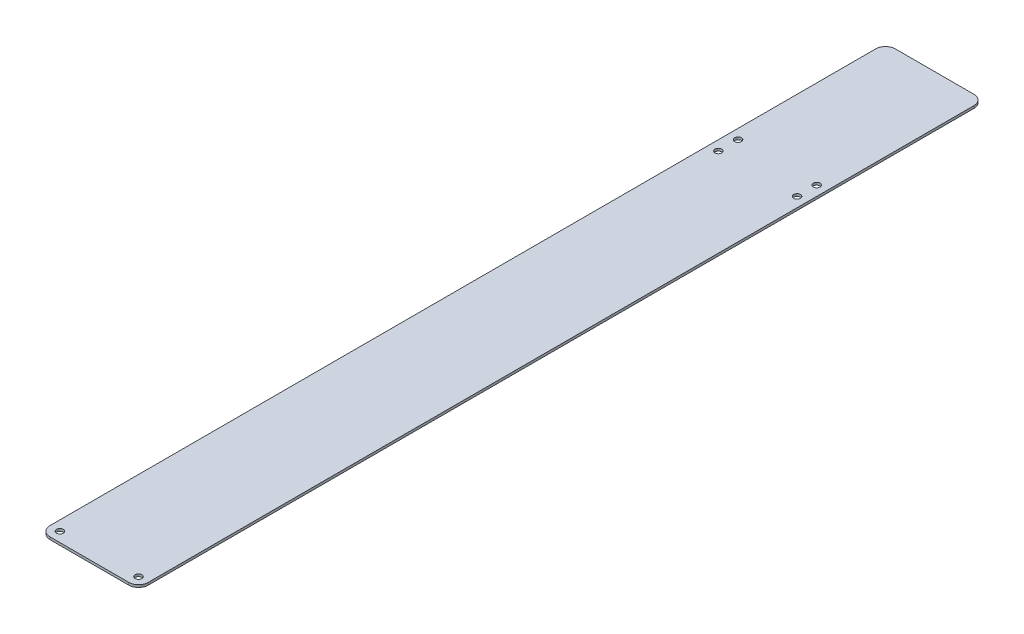
ISO-10303-21;
HEADER;
FILE_DESCRIPTION(('STEP AP214'),'2;1');
FILE_NAME('part.step','',(''),(''),'','','');
FILE_SCHEMA(('AUTOMOTIVE_DESIGN { 1 0 10303 214 1 1 1 1 }'));
ENDSEC;
DATA;
#1=APPLICATION_CONTEXT('core data for automotive mechanical design processes');
#2=APPLICATION_PROTOCOL_DEFINITION('international standard','automotive_design',2000,#1);
#3=PRODUCT_CONTEXT('',#1,'mechanical');
#4=PRODUCT('Part','Part','',(#3));
#5=PRODUCT_RELATED_PRODUCT_CATEGORY('part','',(#4));
#6=PRODUCT_DEFINITION_FORMATION('','',#4);
#7=PRODUCT_DEFINITION_CONTEXT('part definition',#1,'design');
#8=PRODUCT_DEFINITION('design','',#6,#7);
#9=PRODUCT_DEFINITION_SHAPE('','',#8);
#10=(LENGTH_UNIT() NAMED_UNIT(*) SI_UNIT(.MILLI.,.METRE.));
#11=(NAMED_UNIT(*) PLANE_ANGLE_UNIT() SI_UNIT($,.RADIAN.));
#12=(NAMED_UNIT(*) SI_UNIT($,.STERADIAN.) SOLID_ANGLE_UNIT());
#13=UNCERTAINTY_MEASURE_WITH_UNIT(LENGTH_MEASURE(1.E-05),#10,'distance_accuracy_value','');
#14=(GEOMETRIC_REPRESENTATION_CONTEXT(3) GLOBAL_UNCERTAINTY_ASSIGNED_CONTEXT((#13)) GLOBAL_UNIT_ASSIGNED_CONTEXT((#10,
#11,#12)) REPRESENTATION_CONTEXT('',''));
#15=CARTESIAN_POINT('',(0.,0.,0.));
#16=DIRECTION('',(0.,0.,1.));
#17=DIRECTION('',(1.,0.,0.));
#18=AXIS2_PLACEMENT_3D('',#15,#16,#17);
#19=CARTESIAN_POINT('',(6.35,0.79375,-539.75));
#20=DIRECTION('',(0.,1.,0.));
#21=DIRECTION('',(0.,0.,1.));
#22=AXIS2_PLACEMENT_3D('',#19,#20,#21);
#23=PLANE('',#22);
#24=CARTESIAN_POINT('',(57.15,0.79375,-431.8));
#25=DIRECTION('',(0.,1.,0.));
#26=DIRECTION('',(0.,0.,1.));
#27=AXIS2_PLACEMENT_3D('',#24,#25,#26);
#28=CIRCLE('',#27,2.1828125);
#29=CARTESIAN_POINT('',(57.15,0.79375,-429.6171875));
#30=VERTEX_POINT('',#29);
#31=EDGE_CURVE('E239',#30,#30,#28,.T.);
#32=ORIENTED_EDGE('',*,*,#31,.F.);
#33=EDGE_LOOP('',(#32));
#34=FACE_BOUND('',#33,.T.);
#35=CARTESIAN_POINT('',(6.35,0.79375,-6.35));
#36=DIRECTION('',(0.,1.,0.));
#37=DIRECTION('',(0.,0.,1.));
#38=AXIS2_PLACEMENT_3D('',#35,#36,#37);
#39=CIRCLE('',#38,2.1828125);
#40=CARTESIAN_POINT('',(6.35,0.79375,-4.1671875));
#41=VERTEX_POINT('',#40);
#42=EDGE_CURVE('E223',#41,#41,#39,.T.);
#43=ORIENTED_EDGE('',*,*,#42,.F.);
#44=EDGE_LOOP('',(#43));
#45=FACE_BOUND('',#44,.T.);
#46=CARTESIAN_POINT('',(6.35,0.79375,-431.8));
#47=DIRECTION('',(0.,1.,0.));
#48=DIRECTION('',(0.,0.,1.));
#49=AXIS2_PLACEMENT_3D('',#46,#47,#48);
#50=CIRCLE('',#49,2.1828125);
#51=CARTESIAN_POINT('',(6.35,0.79375,-429.6171875));
#52=VERTEX_POINT('',#51);
#53=EDGE_CURVE('E148',#52,#52,#50,.T.);
#54=ORIENTED_EDGE('',*,*,#53,.F.);
#55=EDGE_LOOP('',(#54));
#56=FACE_BOUND('',#55,.T.);
#57=CARTESIAN_POINT('',(6.35,0.79375,-539.75));
#58=DIRECTION('',(0.,1.,0.));
#59=DIRECTION('',(0.,0.,1.));
#60=AXIS2_PLACEMENT_3D('',#57,#58,#59);
#61=CIRCLE('',#60,6.34999999999998);
#62=CARTESIAN_POINT('',(6.35,0.79375,-546.1));
#63=VERTEX_POINT('',#62);
#64=CARTESIAN_POINT('',(0.,0.79375,-539.75));
#65=VERTEX_POINT('',#64);
#66=EDGE_CURVE('E166',#63,#65,#61,.T.);
#67=ORIENTED_EDGE('',*,*,#66,.T.);
#68=DIRECTION('',(0.,0.,1.));
#69=VECTOR('',#68,1.);
#70=CARTESIAN_POINT('',(0.,0.79375,-6.35000000000004));
#71=LINE('',#70,#69);
#72=CARTESIAN_POINT('',(0.,0.79375,-6.35000000000004));
#73=VERTEX_POINT('',#72);
#74=EDGE_CURVE('E102',#65,#73,#71,.T.);
#75=ORIENTED_EDGE('',*,*,#74,.T.);
#76=CARTESIAN_POINT('',(6.35,0.79375,-6.35));
#77=DIRECTION('',(0.,1.,0.));
#78=DIRECTION('',(0.,0.,-1.));
#79=AXIS2_PLACEMENT_3D('',#76,#77,#78);
#80=CIRCLE('',#79,6.35);
#81=CARTESIAN_POINT('',(6.35000000000004,0.79375,0.));
#82=VERTEX_POINT('',#81);
#83=EDGE_CURVE('E187',#73,#82,#80,.T.);
#84=ORIENTED_EDGE('',*,*,#83,.T.);
#85=DIRECTION('',(1.,0.,0.));
#86=VECTOR('',#85,1.);
#87=CARTESIAN_POINT('',(6.35000000000004,0.79375,0.));
#88=LINE('',#87,#86);
#89=CARTESIAN_POINT('',(57.15,0.79375,0.));
#90=VERTEX_POINT('',#89);
#91=EDGE_CURVE('E201',#82,#90,#88,.T.);
#92=ORIENTED_EDGE('',*,*,#91,.T.);
#93=CARTESIAN_POINT('',(57.15,0.79375,-6.35));
#94=DIRECTION('',(0.,1.,0.));
#95=DIRECTION('',(0.,0.,-1.));
#96=AXIS2_PLACEMENT_3D('',#93,#94,#95);
#97=CIRCLE('',#96,6.35);
#98=CARTESIAN_POINT('',(63.5,0.79375,-6.35000000000004));
#99=VERTEX_POINT('',#98);
#100=EDGE_CURVE('E121',#90,#99,#97,.T.);
#101=ORIENTED_EDGE('',*,*,#100,.T.);
#102=DIRECTION('',(0.,0.,-1.));
#103=VECTOR('',#102,1.);
#104=CARTESIAN_POINT('',(63.5,0.79375,-6.35000000000004));
#105=LINE('',#104,#103);
#106=CARTESIAN_POINT('',(63.5,0.79375,-539.75));
#107=VERTEX_POINT('',#106);
#108=EDGE_CURVE('E115',#99,#107,#105,.T.);
#109=ORIENTED_EDGE('',*,*,#108,.T.);
#110=CARTESIAN_POINT('',(57.15,0.79375,-539.75));
#111=DIRECTION('',(0.,1.,0.));
#112=DIRECTION('',(0.,0.,1.));
#113=AXIS2_PLACEMENT_3D('',#110,#111,#112);
#114=CIRCLE('',#113,6.34999999999999);
#115=CARTESIAN_POINT('',(57.15,0.79375,-546.1));
#116=VERTEX_POINT('',#115);
#117=EDGE_CURVE('E119',#107,#116,#114,.T.);
#118=ORIENTED_EDGE('',*,*,#117,.T.);
#119=DIRECTION('',(-1.,0.,0.));
#120=VECTOR('',#119,1.);
#121=CARTESIAN_POINT('',(6.35,0.79375,-546.1));
#122=LINE('',#121,#120);
#123=EDGE_CURVE('E59',#116,#63,#122,.T.);
#124=ORIENTED_EDGE('',*,*,#123,.T.);
#125=EDGE_LOOP('',(#67,#75,#84,#92,#101,#109,#118,#124));
#126=FACE_BOUND('',#125,.T.);
#127=CARTESIAN_POINT('',(6.35,0.79375,-444.5));
#128=DIRECTION('',(0.,1.,0.));
#129=DIRECTION('',(0.,0.,1.));
#130=AXIS2_PLACEMENT_3D('',#127,#128,#129);
#131=CIRCLE('',#130,2.1828125);
#132=CARTESIAN_POINT('',(6.35,0.79375,-442.3171875));
#133=VERTEX_POINT('',#132);
#134=EDGE_CURVE('E215',#133,#133,#131,.T.);
#135=ORIENTED_EDGE('',*,*,#134,.F.);
#136=EDGE_LOOP('',(#135));
#137=FACE_BOUND('',#136,.T.);
#138=CARTESIAN_POINT('',(57.15,0.79375,-6.35));
#139=DIRECTION('',(0.,1.,0.));
#140=DIRECTION('',(0.,0.,1.));
#141=AXIS2_PLACEMENT_3D('',#138,#139,#140);
#142=CIRCLE('',#141,2.1828125);
#143=CARTESIAN_POINT('',(57.15,0.79375,-4.1671875));
#144=VERTEX_POINT('',#143);
#145=EDGE_CURVE('E231',#144,#144,#142,.T.);
#146=ORIENTED_EDGE('',*,*,#145,.F.);
#147=EDGE_LOOP('',(#146));
#148=FACE_BOUND('',#147,.T.);
#149=CARTESIAN_POINT('',(57.15,0.79375,-444.5));
#150=DIRECTION('',(0.,1.,0.));
#151=DIRECTION('',(0.,0.,1.));
#152=AXIS2_PLACEMENT_3D('',#149,#150,#151);
#153=CIRCLE('',#152,2.1828125);
#154=CARTESIAN_POINT('',(57.15,0.79375,-442.3171875));
#155=VERTEX_POINT('',#154);
#156=EDGE_CURVE('E247',#155,#155,#153,.T.);
#157=ORIENTED_EDGE('',*,*,#156,.F.);
#158=EDGE_LOOP('',(#157));
#159=FACE_BOUND('',#158,.T.);
#160=ADVANCED_FACE('F41',(#34,#45,#56,#126,#137,#148,#159),#23,.T.);
#161=CARTESIAN_POINT('',(6.35,-0.79375,-539.75));
#162=DIRECTION('',(0.,1.,0.));
#163=DIRECTION('',(0.,0.,1.));
#164=AXIS2_PLACEMENT_3D('',#161,#162,#163);
#165=PLANE('',#164);
#166=CARTESIAN_POINT('',(6.35,-0.79375,-539.75));
#167=DIRECTION('',(0.,1.,0.));
#168=DIRECTION('',(0.,0.,1.));
#169=AXIS2_PLACEMENT_3D('',#166,#167,#168);
#170=CIRCLE('',#169,6.34999999999998);
#171=CARTESIAN_POINT('',(6.35,-0.79375,-546.1));
#172=VERTEX_POINT('',#171);
#173=CARTESIAN_POINT('',(0.,-0.79375,-539.75));
#174=VERTEX_POINT('',#173);
#175=EDGE_CURVE('E143',#172,#174,#170,.T.);
#176=ORIENTED_EDGE('',*,*,#175,.F.);
#177=DIRECTION('',(-1.,0.,0.));
#178=VECTOR('',#177,1.);
#179=CARTESIAN_POINT('',(6.35,-0.79375,-546.1));
#180=LINE('',#179,#178);
#181=CARTESIAN_POINT('',(57.15,-0.79375,-546.1));
#182=VERTEX_POINT('',#181);
#183=EDGE_CURVE('E94',#182,#172,#180,.T.);
#184=ORIENTED_EDGE('',*,*,#183,.F.);
#185=CARTESIAN_POINT('',(57.15,-0.79375,-539.75));
#186=DIRECTION('',(0.,1.,0.));
#187=DIRECTION('',(0.,0.,1.));
#188=AXIS2_PLACEMENT_3D('',#185,#186,#187);
#189=CIRCLE('',#188,6.34999999999999);
#190=CARTESIAN_POINT('',(63.5,-0.79375,-539.75));
#191=VERTEX_POINT('',#190);
#192=EDGE_CURVE('E88',#191,#182,#189,.T.);
#193=ORIENTED_EDGE('',*,*,#192,.F.);
#194=DIRECTION('',(0.,0.,-1.));
#195=VECTOR('',#194,1.);
#196=CARTESIAN_POINT('',(63.5,-0.79375,-6.35000000000004));
#197=LINE('',#196,#195);
#198=CARTESIAN_POINT('',(63.5,-0.79375,-6.35000000000004));
#199=VERTEX_POINT('',#198);
#200=EDGE_CURVE('E130',#199,#191,#197,.T.);
#201=ORIENTED_EDGE('',*,*,#200,.F.);
#202=CARTESIAN_POINT('',(57.15,-0.79375,-6.35));
#203=DIRECTION('',(0.,1.,0.));
#204=DIRECTION('',(0.,0.,-1.));
#205=AXIS2_PLACEMENT_3D('',#202,#203,#204);
#206=CIRCLE('',#205,6.35);
#207=CARTESIAN_POINT('',(57.15,-0.79375,0.));
#208=VERTEX_POINT('',#207);
#209=EDGE_CURVE('E157',#208,#199,#206,.T.);
#210=ORIENTED_EDGE('',*,*,#209,.F.);
#211=DIRECTION('',(1.,0.,0.));
#212=VECTOR('',#211,1.);
#213=CARTESIAN_POINT('',(6.35000000000004,-0.79375,0.));
#214=LINE('',#213,#212);
#215=CARTESIAN_POINT('',(6.35000000000004,-0.79375,0.));
#216=VERTEX_POINT('',#215);
#217=EDGE_CURVE('E154',#216,#208,#214,.T.);
#218=ORIENTED_EDGE('',*,*,#217,.F.);
#219=CARTESIAN_POINT('',(6.35,-0.79375,-6.35));
#220=DIRECTION('',(0.,1.,0.));
#221=DIRECTION('',(0.,0.,-1.));
#222=AXIS2_PLACEMENT_3D('',#219,#220,#221);
#223=CIRCLE('',#222,6.35);
#224=CARTESIAN_POINT('',(0.,-0.79375,-6.35000000000004));
#225=VERTEX_POINT('',#224);
#226=EDGE_CURVE('E151',#225,#216,#223,.T.);
#227=ORIENTED_EDGE('',*,*,#226,.F.);
#228=DIRECTION('',(0.,0.,1.));
#229=VECTOR('',#228,1.);
#230=CARTESIAN_POINT('',(0.,-0.79375,-6.35000000000004));
#231=LINE('',#230,#229);
#232=EDGE_CURVE('E147',#174,#225,#231,.T.);
#233=ORIENTED_EDGE('',*,*,#232,.F.);
#234=EDGE_LOOP('',(#176,#184,#193,#201,#210,#218,#227,#233));
#235=FACE_BOUND('',#234,.T.);
#236=CARTESIAN_POINT('',(6.35,-0.79375,-431.8));
#237=DIRECTION('',(0.,1.,0.));
#238=DIRECTION('',(0.,0.,1.));
#239=AXIS2_PLACEMENT_3D('',#236,#237,#238);
#240=CIRCLE('',#239,2.1828125);
#241=CARTESIAN_POINT('',(6.35,-0.79375,-429.6171875));
#242=VERTEX_POINT('',#241);
#243=EDGE_CURVE('E211',#242,#242,#240,.T.);
#244=ORIENTED_EDGE('',*,*,#243,.T.);
#245=EDGE_LOOP('',(#244));
#246=FACE_BOUND('',#245,.T.);
#247=CARTESIAN_POINT('',(6.35,-0.79375,-444.5));
#248=DIRECTION('',(0.,1.,0.));
#249=DIRECTION('',(0.,0.,1.));
#250=AXIS2_PLACEMENT_3D('',#247,#248,#249);
#251=CIRCLE('',#250,2.1828125);
#252=CARTESIAN_POINT('',(6.35,-0.79375,-442.3171875));
#253=VERTEX_POINT('',#252);
#254=EDGE_CURVE('E219',#253,#253,#251,.T.);
#255=ORIENTED_EDGE('',*,*,#254,.T.);
#256=EDGE_LOOP('',(#255));
#257=FACE_BOUND('',#256,.T.);
#258=CARTESIAN_POINT('',(6.35,-0.79375,-6.35));
#259=DIRECTION('',(0.,1.,0.));
#260=DIRECTION('',(0.,0.,1.));
#261=AXIS2_PLACEMENT_3D('',#258,#259,#260);
#262=CIRCLE('',#261,2.1828125);
#263=CARTESIAN_POINT('',(6.35,-0.79375,-4.1671875));
#264=VERTEX_POINT('',#263);
#265=EDGE_CURVE('E227',#264,#264,#262,.T.);
#266=ORIENTED_EDGE('',*,*,#265,.T.);
#267=EDGE_LOOP('',(#266));
#268=FACE_BOUND('',#267,.T.);
#269=CARTESIAN_POINT('',(57.15,-0.79375,-6.35));
#270=DIRECTION('',(0.,1.,0.));
#271=DIRECTION('',(0.,0.,1.));
#272=AXIS2_PLACEMENT_3D('',#269,#270,#271);
#273=CIRCLE('',#272,2.1828125);
#274=CARTESIAN_POINT('',(57.15,-0.79375,-4.1671875));
#275=VERTEX_POINT('',#274);
#276=EDGE_CURVE('E235',#275,#275,#273,.T.);
#277=ORIENTED_EDGE('',*,*,#276,.T.);
#278=EDGE_LOOP('',(#277));
#279=FACE_BOUND('',#278,.T.);
#280=CARTESIAN_POINT('',(57.15,-0.79375,-431.8));
#281=DIRECTION('',(0.,1.,0.));
#282=DIRECTION('',(0.,0.,1.));
#283=AXIS2_PLACEMENT_3D('',#280,#281,#282);
#284=CIRCLE('',#283,2.1828125);
#285=CARTESIAN_POINT('',(57.15,-0.79375,-429.6171875));
#286=VERTEX_POINT('',#285);
#287=EDGE_CURVE('E243',#286,#286,#284,.T.);
#288=ORIENTED_EDGE('',*,*,#287,.T.);
#289=EDGE_LOOP('',(#288));
#290=FACE_BOUND('',#289,.T.);
#291=CARTESIAN_POINT('',(57.15,-0.79375,-444.5));
#292=DIRECTION('',(0.,1.,0.));
#293=DIRECTION('',(0.,0.,1.));
#294=AXIS2_PLACEMENT_3D('',#291,#292,#293);
#295=CIRCLE('',#294,2.1828125);
#296=CARTESIAN_POINT('',(57.15,-0.79375,-442.3171875));
#297=VERTEX_POINT('',#296);
#298=EDGE_CURVE('E251',#297,#297,#295,.T.);
#299=ORIENTED_EDGE('',*,*,#298,.T.);
#300=EDGE_LOOP('',(#299));
#301=FACE_BOUND('',#300,.T.);
#302=ADVANCED_FACE('F191',(#235,#246,#257,#268,#279,#290,#301),#165,.F.);
#303=CARTESIAN_POINT('',(6.35,0.79375,-539.75));
#304=DIRECTION('',(0.,-1.,0.));
#305=DIRECTION('',(0.,0.,-1.));
#306=AXIS2_PLACEMENT_3D('',#303,#304,#305);
#307=CYLINDRICAL_SURFACE('',#306,6.34999999999998);
#308=ORIENTED_EDGE('',*,*,#175,.T.);
#309=DIRECTION('',(0.,-1.,0.));
#310=VECTOR('',#309,1.);
#311=CARTESIAN_POINT('',(0.,0.79375,-539.75));
#312=LINE('',#311,#310);
#313=EDGE_CURVE('E11',#65,#174,#312,.T.);
#314=ORIENTED_EDGE('',*,*,#313,.F.);
#315=ORIENTED_EDGE('',*,*,#66,.F.);
#316=DIRECTION('',(0.,-1.,0.));
#317=VECTOR('',#316,1.);
#318=CARTESIAN_POINT('',(6.35,0.79375,-546.1));
#319=LINE('',#318,#317);
#320=EDGE_CURVE('E139',#63,#172,#319,.T.);
#321=ORIENTED_EDGE('',*,*,#320,.T.);
#322=EDGE_LOOP('',(#308,#314,#315,#321));
#323=FACE_BOUND('',#322,.T.);
#324=ADVANCED_FACE('F43',(#323),#307,.T.);
#325=CARTESIAN_POINT('',(0.,0.79375,-6.35000000000004));
#326=DIRECTION('',(1.,0.,0.));
#327=DIRECTION('',(0.,0.,-1.));
#328=AXIS2_PLACEMENT_3D('',#325,#326,#327);
#329=PLANE('',#328);
#330=ORIENTED_EDGE('',*,*,#232,.T.);
#331=DIRECTION('',(0.,-1.,0.));
#332=VECTOR('',#331,1.);
#333=CARTESIAN_POINT('',(0.,0.79375,-6.35000000000004));
#334=LINE('',#333,#332);
#335=EDGE_CURVE('E51',#73,#225,#334,.T.);
#336=ORIENTED_EDGE('',*,*,#335,.F.);
#337=ORIENTED_EDGE('',*,*,#74,.F.);
#338=ORIENTED_EDGE('',*,*,#313,.T.);
#339=EDGE_LOOP('',(#330,#336,#337,#338));
#340=FACE_BOUND('',#339,.T.);
#341=ADVANCED_FACE('F287',(#340),#329,.F.);
#342=CARTESIAN_POINT('',(6.35,0.79375,-6.35));
#343=DIRECTION('',(0.,-1.,0.));
#344=DIRECTION('',(0.,0.,-1.));
#345=AXIS2_PLACEMENT_3D('',#342,#343,#344);
#346=CYLINDRICAL_SURFACE('',#345,6.35);
#347=ORIENTED_EDGE('',*,*,#226,.T.);
#348=DIRECTION('',(0.,-1.,0.));
#349=VECTOR('',#348,1.);
#350=CARTESIAN_POINT('',(6.35000000000004,0.79375,0.));
#351=LINE('',#350,#349);
#352=EDGE_CURVE('E177',#82,#216,#351,.T.);
#353=ORIENTED_EDGE('',*,*,#352,.F.);
#354=ORIENTED_EDGE('',*,*,#83,.F.);
#355=ORIENTED_EDGE('',*,*,#335,.T.);
#356=EDGE_LOOP('',(#347,#353,#354,#355));
#357=FACE_BOUND('',#356,.T.);
#358=ADVANCED_FACE('F185',(#357),#346,.T.);
#359=CARTESIAN_POINT('',(6.35000000000004,0.79375,0.));
#360=DIRECTION('',(0.,0.,-1.));
#361=DIRECTION('',(-1.,0.,0.));
#362=AXIS2_PLACEMENT_3D('',#359,#360,#361);
#363=PLANE('',#362);
#364=ORIENTED_EDGE('',*,*,#217,.T.);
#365=DIRECTION('',(0.,-1.,0.));
#366=VECTOR('',#365,1.);
#367=CARTESIAN_POINT('',(57.15,0.79375,0.));
#368=LINE('',#367,#366);
#369=EDGE_CURVE('E173',#90,#208,#368,.T.);
#370=ORIENTED_EDGE('',*,*,#369,.F.);
#371=ORIENTED_EDGE('',*,*,#91,.F.);
#372=ORIENTED_EDGE('',*,*,#352,.T.);
#373=EDGE_LOOP('',(#364,#370,#371,#372));
#374=FACE_BOUND('',#373,.T.);
#375=ADVANCED_FACE('F196',(#374),#363,.F.);
#376=CARTESIAN_POINT('',(57.15,0.79375,-6.35));
#377=DIRECTION('',(0.,-1.,0.));
#378=DIRECTION('',(0.,0.,-1.));
#379=AXIS2_PLACEMENT_3D('',#376,#377,#378);
#380=CYLINDRICAL_SURFACE('',#379,6.35);
#381=ORIENTED_EDGE('',*,*,#209,.T.);
#382=DIRECTION('',(0.,-1.,0.));
#383=VECTOR('',#382,1.);
#384=CARTESIAN_POINT('',(63.5,0.79375,-6.35000000000004));
#385=LINE('',#384,#383);
#386=EDGE_CURVE('E132',#99,#199,#385,.T.);
#387=ORIENTED_EDGE('',*,*,#386,.F.);
#388=ORIENTED_EDGE('',*,*,#100,.F.);
#389=ORIENTED_EDGE('',*,*,#369,.T.);
#390=EDGE_LOOP('',(#381,#387,#388,#389));
#391=FACE_BOUND('',#390,.T.);
#392=ADVANCED_FACE('F199',(#391),#380,.T.);
#393=CARTESIAN_POINT('',(63.5,0.79375,-6.35000000000004));
#394=DIRECTION('',(-1.,0.,0.));
#395=DIRECTION('',(0.,0.,1.));
#396=AXIS2_PLACEMENT_3D('',#393,#394,#395);
#397=PLANE('',#396);
#398=ORIENTED_EDGE('',*,*,#200,.T.);
#399=DIRECTION('',(0.,-1.,0.));
#400=VECTOR('',#399,1.);
#401=CARTESIAN_POINT('',(63.5,0.79375,-539.75));
#402=LINE('',#401,#400);
#403=EDGE_CURVE('E127',#107,#191,#402,.T.);
#404=ORIENTED_EDGE('',*,*,#403,.F.);
#405=ORIENTED_EDGE('',*,*,#108,.F.);
#406=ORIENTED_EDGE('',*,*,#386,.T.);
#407=EDGE_LOOP('',(#398,#404,#405,#406));
#408=FACE_BOUND('',#407,.T.);
#409=ADVANCED_FACE('F128',(#408),#397,.F.);
#410=CARTESIAN_POINT('',(57.15,0.79375,-539.75));
#411=DIRECTION('',(0.,-1.,0.));
#412=DIRECTION('',(0.,0.,-1.));
#413=AXIS2_PLACEMENT_3D('',#410,#411,#412);
#414=CYLINDRICAL_SURFACE('',#413,6.34999999999999);
#415=ORIENTED_EDGE('',*,*,#192,.T.);
#416=DIRECTION('',(0.,-1.,0.));
#417=VECTOR('',#416,1.);
#418=CARTESIAN_POINT('',(57.15,0.79375,-546.1));
#419=LINE('',#418,#417);
#420=EDGE_CURVE('E133',#116,#182,#419,.T.);
#421=ORIENTED_EDGE('',*,*,#420,.F.);
#422=ORIENTED_EDGE('',*,*,#117,.F.);
#423=ORIENTED_EDGE('',*,*,#403,.T.);
#424=EDGE_LOOP('',(#415,#421,#422,#423));
#425=FACE_BOUND('',#424,.T.);
#426=ADVANCED_FACE('F135',(#425),#414,.T.);
#427=CARTESIAN_POINT('',(6.35,0.79375,-546.1));
#428=DIRECTION('',(0.,0.,1.));
#429=DIRECTION('',(1.,0.,0.));
#430=AXIS2_PLACEMENT_3D('',#427,#428,#429);
#431=PLANE('',#430);
#432=ORIENTED_EDGE('',*,*,#183,.T.);
#433=ORIENTED_EDGE('',*,*,#320,.F.);
#434=ORIENTED_EDGE('',*,*,#123,.F.);
#435=ORIENTED_EDGE('',*,*,#420,.T.);
#436=EDGE_LOOP('',(#432,#433,#434,#435));
#437=FACE_BOUND('',#436,.T.);
#438=ADVANCED_FACE('F275',(#437),#431,.F.);
#439=CARTESIAN_POINT('',(6.35,0.79375,-431.8));
#440=DIRECTION('',(0.,-1.,0.));
#441=DIRECTION('',(0.,0.,-1.));
#442=AXIS2_PLACEMENT_3D('',#439,#440,#441);
#443=CYLINDRICAL_SURFACE('',#442,2.1828125);
#444=ORIENTED_EDGE('',*,*,#53,.T.);
#445=EDGE_LOOP('',(#444));
#446=FACE_BOUND('',#445,.T.);
#447=ORIENTED_EDGE('',*,*,#243,.F.);
#448=EDGE_LOOP('',(#447));
#449=FACE_BOUND('',#448,.T.);
#450=ADVANCED_FACE('F272',(#446,#449),#443,.F.);
#451=CARTESIAN_POINT('',(6.35,0.79375,-444.5));
#452=DIRECTION('',(0.,-1.,0.));
#453=DIRECTION('',(0.,0.,-1.));
#454=AXIS2_PLACEMENT_3D('',#451,#452,#453);
#455=CYLINDRICAL_SURFACE('',#454,2.1828125);
#456=ORIENTED_EDGE('',*,*,#134,.T.);
#457=EDGE_LOOP('',(#456));
#458=FACE_BOUND('',#457,.T.);
#459=ORIENTED_EDGE('',*,*,#254,.F.);
#460=EDGE_LOOP('',(#459));
#461=FACE_BOUND('',#460,.T.);
#462=ADVANCED_FACE('F351',(#458,#461),#455,.F.);
#463=CARTESIAN_POINT('',(6.35,0.79375,-6.35));
#464=DIRECTION('',(0.,-1.,0.));
#465=DIRECTION('',(0.,0.,-1.));
#466=AXIS2_PLACEMENT_3D('',#463,#464,#465);
#467=CYLINDRICAL_SURFACE('',#466,2.1828125);
#468=ORIENTED_EDGE('',*,*,#42,.T.);
#469=EDGE_LOOP('',(#468));
#470=FACE_BOUND('',#469,.T.);
#471=ORIENTED_EDGE('',*,*,#265,.F.);
#472=EDGE_LOOP('',(#471));
#473=FACE_BOUND('',#472,.T.);
#474=ADVANCED_FACE('F359',(#470,#473),#467,.F.);
#475=CARTESIAN_POINT('',(57.15,0.79375,-6.35));
#476=DIRECTION('',(0.,-1.,0.));
#477=DIRECTION('',(0.,0.,-1.));
#478=AXIS2_PLACEMENT_3D('',#475,#476,#477);
#479=CYLINDRICAL_SURFACE('',#478,2.1828125);
#480=ORIENTED_EDGE('',*,*,#145,.T.);
#481=EDGE_LOOP('',(#480));
#482=FACE_BOUND('',#481,.T.);
#483=ORIENTED_EDGE('',*,*,#276,.F.);
#484=EDGE_LOOP('',(#483));
#485=FACE_BOUND('',#484,.T.);
#486=ADVANCED_FACE('F367',(#482,#485),#479,.F.);
#487=CARTESIAN_POINT('',(57.15,0.79375,-431.8));
#488=DIRECTION('',(0.,-1.,0.));
#489=DIRECTION('',(0.,0.,-1.));
#490=AXIS2_PLACEMENT_3D('',#487,#488,#489);
#491=CYLINDRICAL_SURFACE('',#490,2.1828125);
#492=ORIENTED_EDGE('',*,*,#31,.T.);
#493=EDGE_LOOP('',(#492));
#494=FACE_BOUND('',#493,.T.);
#495=ORIENTED_EDGE('',*,*,#287,.F.);
#496=EDGE_LOOP('',(#495));
#497=FACE_BOUND('',#496,.T.);
#498=ADVANCED_FACE('F376',(#494,#497),#491,.F.);
#499=CARTESIAN_POINT('',(57.15,0.79375,-444.5));
#500=DIRECTION('',(0.,-1.,0.));
#501=DIRECTION('',(0.,0.,-1.));
#502=AXIS2_PLACEMENT_3D('',#499,#500,#501);
#503=CYLINDRICAL_SURFACE('',#502,2.1828125);
#504=ORIENTED_EDGE('',*,*,#156,.T.);
#505=EDGE_LOOP('',(#504));
#506=FACE_BOUND('',#505,.T.);
#507=ORIENTED_EDGE('',*,*,#298,.F.);
#508=EDGE_LOOP('',(#507));
#509=FACE_BOUND('',#508,.T.);
#510=ADVANCED_FACE('F259',(#506,#509),#503,.F.);
#511=CLOSED_SHELL('',(#160,#302,#324,#341,#358,#375,#392,#409,#426,#438,#450,#462,#474,#486,
#498,#510));
#512=MANIFOLD_SOLID_BREP('B2',#511);
#513=ADVANCED_BREP_SHAPE_REPRESENTATION('',(#18,#512),#14);
#514=SHAPE_DEFINITION_REPRESENTATION(#9,#513);
ENDSEC;
END-ISO-10303-21;
